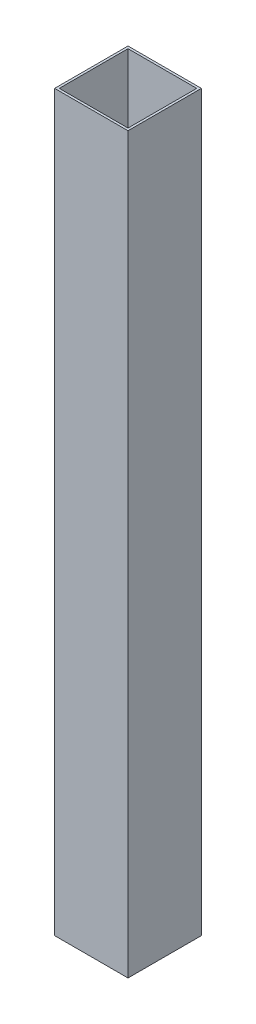
ISO-10303-21;
HEADER;
FILE_DESCRIPTION(('STEP AP214'),'2;1');
FILE_NAME('part.step','',(''),(''),'','','');
FILE_SCHEMA(('AUTOMOTIVE_DESIGN { 1 0 10303 214 1 1 1 1 }'));
ENDSEC;
DATA;
#1=APPLICATION_CONTEXT('core data for automotive mechanical design processes');
#2=APPLICATION_PROTOCOL_DEFINITION('international standard','automotive_design',2000,#1);
#3=PRODUCT_CONTEXT('',#1,'mechanical');
#4=PRODUCT('Part','Part','',(#3));
#5=PRODUCT_RELATED_PRODUCT_CATEGORY('part','',(#4));
#6=PRODUCT_DEFINITION_FORMATION('','',#4);
#7=PRODUCT_DEFINITION_CONTEXT('part definition',#1,'design');
#8=PRODUCT_DEFINITION('design','',#6,#7);
#9=PRODUCT_DEFINITION_SHAPE('','',#8);
#10=(LENGTH_UNIT() NAMED_UNIT(*) SI_UNIT(.MILLI.,.METRE.));
#11=(NAMED_UNIT(*) PLANE_ANGLE_UNIT() SI_UNIT($,.RADIAN.));
#12=(NAMED_UNIT(*) SI_UNIT($,.STERADIAN.) SOLID_ANGLE_UNIT());
#13=UNCERTAINTY_MEASURE_WITH_UNIT(LENGTH_MEASURE(1.E-05),#10,'distance_accuracy_value','');
#14=(GEOMETRIC_REPRESENTATION_CONTEXT(3) GLOBAL_UNCERTAINTY_ASSIGNED_CONTEXT((#13)) GLOBAL_UNIT_ASSIGNED_CONTEXT((#10,
#11,#12)) REPRESENTATION_CONTEXT('',''));
#15=CARTESIAN_POINT('',(0.,0.,0.));
#16=DIRECTION('',(0.,0.,1.));
#17=DIRECTION('',(1.,0.,0.));
#18=AXIS2_PLACEMENT_3D('',#15,#16,#17);
#19=CARTESIAN_POINT('',(0.,508.,0.));
#20=DIRECTION('',(0.,-1.,0.));
#21=DIRECTION('',(0.,0.,-1.));
#22=AXIS2_PLACEMENT_3D('',#19,#20,#21);
#23=PLANE('',#22);
#24=DIRECTION('',(0.,0.,1.));
#25=VECTOR('',#24,1.);
#26=CARTESIAN_POINT('',(0.,508.,0.));
#27=LINE('',#26,#25);
#28=CARTESIAN_POINT('',(0.,508.,-50.8));
#29=VERTEX_POINT('',#28);
#30=CARTESIAN_POINT('',(0.,508.,0.));
#31=VERTEX_POINT('',#30);
#32=EDGE_CURVE('E134',#29,#31,#27,.T.);
#33=ORIENTED_EDGE('',*,*,#32,.T.);
#34=DIRECTION('',(1.,0.,0.));
#35=VECTOR('',#34,1.);
#36=CARTESIAN_POINT('',(0.,508.,0.));
#37=LINE('',#36,#35);
#38=CARTESIAN_POINT('',(50.8,508.,0.));
#39=VERTEX_POINT('',#38);
#40=EDGE_CURVE('E137',#31,#39,#37,.T.);
#41=ORIENTED_EDGE('',*,*,#40,.T.);
#42=DIRECTION('',(0.,0.,-1.));
#43=VECTOR('',#42,1.);
#44=CARTESIAN_POINT('',(50.8,508.,0.));
#45=LINE('',#44,#43);
#46=CARTESIAN_POINT('',(50.8,508.,-50.8));
#47=VERTEX_POINT('',#46);
#48=EDGE_CURVE('E140',#39,#47,#45,.T.);
#49=ORIENTED_EDGE('',*,*,#48,.T.);
#50=DIRECTION('',(-1.,0.,0.));
#51=VECTOR('',#50,1.);
#52=CARTESIAN_POINT('',(0.,508.,-50.8));
#53=LINE('',#52,#51);
#54=EDGE_CURVE('E142',#47,#29,#53,.T.);
#55=ORIENTED_EDGE('',*,*,#54,.T.);
#56=EDGE_LOOP('',(#33,#41,#49,#55));
#57=FACE_BOUND('',#56,.T.);
#58=DIRECTION('',(0.,0.,1.));
#59=VECTOR('',#58,1.);
#60=CARTESIAN_POINT('',(1.60019999999999,508.,-49.1998));
#61=LINE('',#60,#59);
#62=CARTESIAN_POINT('',(1.60019999999999,508.,-49.1998));
#63=VERTEX_POINT('',#62);
#64=CARTESIAN_POINT('',(1.6002,508.,-1.6002));
#65=VERTEX_POINT('',#64);
#66=EDGE_CURVE('E98',#63,#65,#61,.T.);
#67=ORIENTED_EDGE('',*,*,#66,.F.);
#68=DIRECTION('',(-1.,0.,0.));
#69=VECTOR('',#68,1.);
#70=CARTESIAN_POINT('',(1.60019999999999,508.,-49.1998));
#71=LINE('',#70,#69);
#72=CARTESIAN_POINT('',(49.1998,508.,-49.1998));
#73=VERTEX_POINT('',#72);
#74=EDGE_CURVE('E120',#73,#63,#71,.T.);
#75=ORIENTED_EDGE('',*,*,#74,.F.);
#76=DIRECTION('',(0.,0.,-1.));
#77=VECTOR('',#76,1.);
#78=CARTESIAN_POINT('',(49.1998,508.,-49.1998));
#79=LINE('',#78,#77);
#80=CARTESIAN_POINT('',(49.1998,508.,-1.6002));
#81=VERTEX_POINT('',#80);
#82=EDGE_CURVE('E118',#81,#73,#79,.T.);
#83=ORIENTED_EDGE('',*,*,#82,.F.);
#84=DIRECTION('',(1.,0.,0.));
#85=VECTOR('',#84,1.);
#86=CARTESIAN_POINT('',(1.6002,508.,-1.6002));
#87=LINE('',#86,#85);
#88=EDGE_CURVE('E106',#65,#81,#87,.T.);
#89=ORIENTED_EDGE('',*,*,#88,.F.);
#90=EDGE_LOOP('',(#67,#75,#83,#89));
#91=FACE_BOUND('',#90,.T.);
#92=ADVANCED_FACE('F33',(#57,#91),#23,.F.);
#93=CARTESIAN_POINT('',(0.,0.,0.));
#94=DIRECTION('',(0.,-1.,0.));
#95=DIRECTION('',(0.,0.,-1.));
#96=AXIS2_PLACEMENT_3D('',#93,#94,#95);
#97=PLANE('',#96);
#98=DIRECTION('',(0.,0.,1.));
#99=VECTOR('',#98,1.);
#100=CARTESIAN_POINT('',(0.,0.,0.));
#101=LINE('',#100,#99);
#102=CARTESIAN_POINT('',(0.,0.,-50.8));
#103=VERTEX_POINT('',#102);
#104=CARTESIAN_POINT('',(0.,0.,0.));
#105=VERTEX_POINT('',#104);
#106=EDGE_CURVE('E114',#103,#105,#101,.T.);
#107=ORIENTED_EDGE('',*,*,#106,.F.);
#108=DIRECTION('',(-1.,0.,0.));
#109=VECTOR('',#108,1.);
#110=CARTESIAN_POINT('',(0.,0.,-50.8));
#111=LINE('',#110,#109);
#112=CARTESIAN_POINT('',(50.8,0.,-50.8));
#113=VERTEX_POINT('',#112);
#114=EDGE_CURVE('E138',#113,#103,#111,.T.);
#115=ORIENTED_EDGE('',*,*,#114,.F.);
#116=DIRECTION('',(0.,0.,-1.));
#117=VECTOR('',#116,1.);
#118=CARTESIAN_POINT('',(50.8,0.,0.));
#119=LINE('',#118,#117);
#120=CARTESIAN_POINT('',(50.8,0.,0.));
#121=VERTEX_POINT('',#120);
#122=EDGE_CURVE('E149',#121,#113,#119,.T.);
#123=ORIENTED_EDGE('',*,*,#122,.F.);
#124=DIRECTION('',(1.,0.,0.));
#125=VECTOR('',#124,1.);
#126=CARTESIAN_POINT('',(0.,0.,0.));
#127=LINE('',#126,#125);
#128=EDGE_CURVE('E147',#105,#121,#127,.T.);
#129=ORIENTED_EDGE('',*,*,#128,.F.);
#130=EDGE_LOOP('',(#107,#115,#123,#129));
#131=FACE_BOUND('',#130,.T.);
#132=DIRECTION('',(-1.,0.,0.));
#133=VECTOR('',#132,1.);
#134=CARTESIAN_POINT('',(1.60019999999999,0.,-49.1998));
#135=LINE('',#134,#133);
#136=CARTESIAN_POINT('',(49.1998,0.,-49.1998));
#137=VERTEX_POINT('',#136);
#138=CARTESIAN_POINT('',(1.60019999999999,0.,-49.1998));
#139=VERTEX_POINT('',#138);
#140=EDGE_CURVE('E107',#137,#139,#135,.T.);
#141=ORIENTED_EDGE('',*,*,#140,.T.);
#142=DIRECTION('',(0.,0.,1.));
#143=VECTOR('',#142,1.);
#144=CARTESIAN_POINT('',(1.60019999999999,0.,-49.1998));
#145=LINE('',#144,#143);
#146=CARTESIAN_POINT('',(1.6002,0.,-1.6002));
#147=VERTEX_POINT('',#146);
#148=EDGE_CURVE('E56',#139,#147,#145,.T.);
#149=ORIENTED_EDGE('',*,*,#148,.T.);
#150=DIRECTION('',(1.,0.,0.));
#151=VECTOR('',#150,1.);
#152=CARTESIAN_POINT('',(1.6002,0.,-1.6002));
#153=LINE('',#152,#151);
#154=CARTESIAN_POINT('',(49.1998,0.,-1.6002));
#155=VERTEX_POINT('',#154);
#156=EDGE_CURVE('E113',#147,#155,#153,.T.);
#157=ORIENTED_EDGE('',*,*,#156,.T.);
#158=DIRECTION('',(0.,0.,-1.));
#159=VECTOR('',#158,1.);
#160=CARTESIAN_POINT('',(49.1998,0.,-49.1998));
#161=LINE('',#160,#159);
#162=EDGE_CURVE('E126',#155,#137,#161,.T.);
#163=ORIENTED_EDGE('',*,*,#162,.T.);
#164=EDGE_LOOP('',(#141,#149,#157,#163));
#165=FACE_BOUND('',#164,.T.);
#166=ADVANCED_FACE('F167',(#131,#165),#97,.T.);
#167=CARTESIAN_POINT('',(0.,508.,0.));
#168=DIRECTION('',(1.,0.,0.));
#169=DIRECTION('',(0.,0.,-1.));
#170=AXIS2_PLACEMENT_3D('',#167,#168,#169);
#171=PLANE('',#170);
#172=ORIENTED_EDGE('',*,*,#106,.T.);
#173=DIRECTION('',(0.,-1.,0.));
#174=VECTOR('',#173,1.);
#175=CARTESIAN_POINT('',(0.,508.,0.));
#176=LINE('',#175,#174);
#177=EDGE_CURVE('E11',#31,#105,#176,.T.);
#178=ORIENTED_EDGE('',*,*,#177,.F.);
#179=ORIENTED_EDGE('',*,*,#32,.F.);
#180=DIRECTION('',(0.,-1.,0.));
#181=VECTOR('',#180,1.);
#182=CARTESIAN_POINT('',(0.,508.,-50.8));
#183=LINE('',#182,#181);
#184=EDGE_CURVE('E144',#29,#103,#183,.T.);
#185=ORIENTED_EDGE('',*,*,#184,.T.);
#186=EDGE_LOOP('',(#172,#178,#179,#185));
#187=FACE_BOUND('',#186,.T.);
#188=ADVANCED_FACE('F35',(#187),#171,.F.);
#189=CARTESIAN_POINT('',(0.,508.,0.));
#190=DIRECTION('',(0.,0.,-1.));
#191=DIRECTION('',(-1.,0.,0.));
#192=AXIS2_PLACEMENT_3D('',#189,#190,#191);
#193=PLANE('',#192);
#194=ORIENTED_EDGE('',*,*,#128,.T.);
#195=DIRECTION('',(0.,-1.,0.));
#196=VECTOR('',#195,1.);
#197=CARTESIAN_POINT('',(50.8,508.,0.));
#198=LINE('',#197,#196);
#199=EDGE_CURVE('E41',#39,#121,#198,.T.);
#200=ORIENTED_EDGE('',*,*,#199,.F.);
#201=ORIENTED_EDGE('',*,*,#40,.F.);
#202=ORIENTED_EDGE('',*,*,#177,.T.);
#203=EDGE_LOOP('',(#194,#200,#201,#202));
#204=FACE_BOUND('',#203,.T.);
#205=ADVANCED_FACE('F177',(#204),#193,.F.);
#206=CARTESIAN_POINT('',(50.8,508.,0.));
#207=DIRECTION('',(-1.,0.,0.));
#208=DIRECTION('',(0.,0.,1.));
#209=AXIS2_PLACEMENT_3D('',#206,#207,#208);
#210=PLANE('',#209);
#211=ORIENTED_EDGE('',*,*,#122,.T.);
#212=DIRECTION('',(0.,-1.,0.));
#213=VECTOR('',#212,1.);
#214=CARTESIAN_POINT('',(50.8,508.,-50.8));
#215=LINE('',#214,#213);
#216=EDGE_CURVE('E154',#47,#113,#215,.T.);
#217=ORIENTED_EDGE('',*,*,#216,.F.);
#218=ORIENTED_EDGE('',*,*,#48,.F.);
#219=ORIENTED_EDGE('',*,*,#199,.T.);
#220=EDGE_LOOP('',(#211,#217,#218,#219));
#221=FACE_BOUND('',#220,.T.);
#222=ADVANCED_FACE('F161',(#221),#210,.F.);
#223=CARTESIAN_POINT('',(0.,508.,-50.8));
#224=DIRECTION('',(0.,0.,1.));
#225=DIRECTION('',(1.,0.,0.));
#226=AXIS2_PLACEMENT_3D('',#223,#224,#225);
#227=PLANE('',#226);
#228=ORIENTED_EDGE('',*,*,#114,.T.);
#229=ORIENTED_EDGE('',*,*,#184,.F.);
#230=ORIENTED_EDGE('',*,*,#54,.F.);
#231=ORIENTED_EDGE('',*,*,#216,.T.);
#232=EDGE_LOOP('',(#228,#229,#230,#231));
#233=FACE_BOUND('',#232,.T.);
#234=ADVANCED_FACE('F171',(#233),#227,.F.);
#235=CARTESIAN_POINT('',(1.60019999999999,508.,-49.1998));
#236=DIRECTION('',(1.,0.,0.));
#237=DIRECTION('',(0.,0.,-1.));
#238=AXIS2_PLACEMENT_3D('',#235,#236,#237);
#239=PLANE('',#238);
#240=ORIENTED_EDGE('',*,*,#148,.F.);
#241=DIRECTION('',(0.,-1.,0.));
#242=VECTOR('',#241,1.);
#243=CARTESIAN_POINT('',(1.60019999999999,508.,-49.1998));
#244=LINE('',#243,#242);
#245=EDGE_CURVE('E102',#63,#139,#244,.T.);
#246=ORIENTED_EDGE('',*,*,#245,.F.);
#247=ORIENTED_EDGE('',*,*,#66,.T.);
#248=DIRECTION('',(0.,-1.,0.));
#249=VECTOR('',#248,1.);
#250=CARTESIAN_POINT('',(1.6002,508.,-1.6002));
#251=LINE('',#250,#249);
#252=EDGE_CURVE('E101',#65,#147,#251,.T.);
#253=ORIENTED_EDGE('',*,*,#252,.T.);
#254=EDGE_LOOP('',(#240,#246,#247,#253));
#255=FACE_BOUND('',#254,.T.);
#256=ADVANCED_FACE('F100',(#255),#239,.T.);
#257=CARTESIAN_POINT('',(1.6002,508.,-1.6002));
#258=DIRECTION('',(0.,0.,-1.));
#259=DIRECTION('',(-1.,0.,0.));
#260=AXIS2_PLACEMENT_3D('',#257,#258,#259);
#261=PLANE('',#260);
#262=ORIENTED_EDGE('',*,*,#156,.F.);
#263=ORIENTED_EDGE('',*,*,#252,.F.);
#264=ORIENTED_EDGE('',*,*,#88,.T.);
#265=DIRECTION('',(0.,-1.,0.));
#266=VECTOR('',#265,1.);
#267=CARTESIAN_POINT('',(49.1998,508.,-1.6002));
#268=LINE('',#267,#266);
#269=EDGE_CURVE('E115',#81,#155,#268,.T.);
#270=ORIENTED_EDGE('',*,*,#269,.T.);
#271=EDGE_LOOP('',(#262,#263,#264,#270));
#272=FACE_BOUND('',#271,.T.);
#273=ADVANCED_FACE('F110',(#272),#261,.T.);
#274=CARTESIAN_POINT('',(49.1998,508.,-49.1998));
#275=DIRECTION('',(-1.,0.,0.));
#276=DIRECTION('',(0.,0.,1.));
#277=AXIS2_PLACEMENT_3D('',#274,#275,#276);
#278=PLANE('',#277);
#279=ORIENTED_EDGE('',*,*,#162,.F.);
#280=ORIENTED_EDGE('',*,*,#269,.F.);
#281=ORIENTED_EDGE('',*,*,#82,.T.);
#282=DIRECTION('',(0.,-1.,0.));
#283=VECTOR('',#282,1.);
#284=CARTESIAN_POINT('',(49.1998,508.,-49.1998));
#285=LINE('',#284,#283);
#286=EDGE_CURVE('E48',#73,#137,#285,.T.);
#287=ORIENTED_EDGE('',*,*,#286,.T.);
#288=EDGE_LOOP('',(#279,#280,#281,#287));
#289=FACE_BOUND('',#288,.T.);
#290=ADVANCED_FACE('F200',(#289),#278,.T.);
#291=CARTESIAN_POINT('',(1.60019999999999,508.,-49.1998));
#292=DIRECTION('',(0.,0.,1.));
#293=DIRECTION('',(1.,0.,0.));
#294=AXIS2_PLACEMENT_3D('',#291,#292,#293);
#295=PLANE('',#294);
#296=ORIENTED_EDGE('',*,*,#140,.F.);
#297=ORIENTED_EDGE('',*,*,#286,.F.);
#298=ORIENTED_EDGE('',*,*,#74,.T.);
#299=ORIENTED_EDGE('',*,*,#245,.T.);
#300=EDGE_LOOP('',(#296,#297,#298,#299));
#301=FACE_BOUND('',#300,.T.);
#302=ADVANCED_FACE('F204',(#301),#295,.T.);
#303=CLOSED_SHELL('',(#92,#166,#188,#205,#222,#234,#256,#273,#290,#302));
#304=MANIFOLD_SOLID_BREP('B2',#303);
#305=ADVANCED_BREP_SHAPE_REPRESENTATION('',(#18,#304),#14);
#306=SHAPE_DEFINITION_REPRESENTATION(#9,#305);
ENDSEC;
END-ISO-10303-21;
